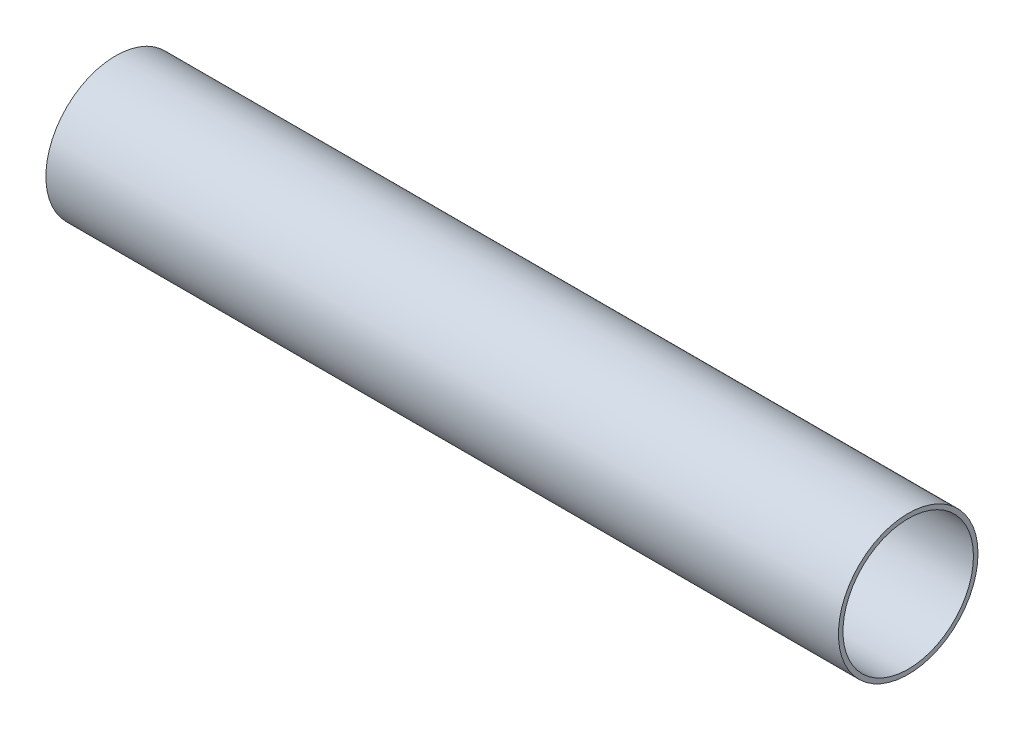
ISO-10303-21;
HEADER;
FILE_DESCRIPTION(('STEP AP214'),'2;1');
FILE_NAME('part.step','',(''),(''),'','','');
FILE_SCHEMA(('AUTOMOTIVE_DESIGN { 1 0 10303 214 1 1 1 1 }'));
ENDSEC;
DATA;
#1=APPLICATION_CONTEXT('core data for automotive mechanical design processes');
#2=APPLICATION_PROTOCOL_DEFINITION('international standard','automotive_design',2000,#1);
#3=PRODUCT_CONTEXT('',#1,'mechanical');
#4=PRODUCT('Part','Part','',(#3));
#5=PRODUCT_RELATED_PRODUCT_CATEGORY('part','',(#4));
#6=PRODUCT_DEFINITION_FORMATION('','',#4);
#7=PRODUCT_DEFINITION_CONTEXT('part definition',#1,'design');
#8=PRODUCT_DEFINITION('design','',#6,#7);
#9=PRODUCT_DEFINITION_SHAPE('','',#8);
#10=(LENGTH_UNIT() NAMED_UNIT(*) SI_UNIT(.MILLI.,.METRE.));
#11=(NAMED_UNIT(*) PLANE_ANGLE_UNIT() SI_UNIT($,.RADIAN.));
#12=(NAMED_UNIT(*) SI_UNIT($,.STERADIAN.) SOLID_ANGLE_UNIT());
#13=UNCERTAINTY_MEASURE_WITH_UNIT(LENGTH_MEASURE(1.E-05),#10,'distance_accuracy_value','');
#14=(GEOMETRIC_REPRESENTATION_CONTEXT(3) GLOBAL_UNCERTAINTY_ASSIGNED_CONTEXT((#13)) GLOBAL_UNIT_ASSIGNED_CONTEXT((#10,
#11,#12)) REPRESENTATION_CONTEXT('',''));
#15=CARTESIAN_POINT('',(0.,0.,0.));
#16=DIRECTION('',(0.,0.,1.));
#17=DIRECTION('',(1.,0.,0.));
#18=AXIS2_PLACEMENT_3D('',#15,#16,#17);
#19=CARTESIAN_POINT('',(520.7,0.,0.));
#20=DIRECTION('',(1.,0.,0.));
#21=DIRECTION('',(0.,0.,-1.));
#22=AXIS2_PLACEMENT_3D('',#19,#20,#21);
#23=PLANE('',#22);
#24=CARTESIAN_POINT('',(520.7,0.,0.));
#25=DIRECTION('',(1.,0.,0.));
#26=DIRECTION('',(0.,0.,-1.));
#27=AXIS2_PLACEMENT_3D('',#24,#25,#26);
#28=CIRCLE('',#27,45.847);
#29=CARTESIAN_POINT('',(520.7,0.,-45.847));
#30=VERTEX_POINT('',#29);
#31=EDGE_CURVE('E10',#30,#30,#28,.T.);
#32=ORIENTED_EDGE('',*,*,#31,.T.);
#33=EDGE_LOOP('',(#32));
#34=FACE_BOUND('',#33,.T.);
#35=CARTESIAN_POINT('',(520.7,0.,0.));
#36=DIRECTION('',(1.,0.,0.));
#37=DIRECTION('',(0.,0.,-1.));
#38=AXIS2_PLACEMENT_3D('',#35,#36,#37);
#39=CIRCLE('',#38,42.8625);
#40=CARTESIAN_POINT('',(520.7,0.,-42.8625));
#41=VERTEX_POINT('',#40);
#42=EDGE_CURVE('E47',#41,#41,#39,.T.);
#43=ORIENTED_EDGE('',*,*,#42,.F.);
#44=EDGE_LOOP('',(#43));
#45=FACE_BOUND('',#44,.T.);
#46=ADVANCED_FACE('F36',(#34,#45),#23,.T.);
#47=CARTESIAN_POINT('',(0.,0.,0.));
#48=DIRECTION('',(1.,0.,0.));
#49=DIRECTION('',(0.,0.,-1.));
#50=AXIS2_PLACEMENT_3D('',#47,#48,#49);
#51=PLANE('',#50);
#52=CARTESIAN_POINT('',(0.,0.,0.));
#53=DIRECTION('',(1.,0.,0.));
#54=DIRECTION('',(0.,0.,-1.));
#55=AXIS2_PLACEMENT_3D('',#52,#53,#54);
#56=CIRCLE('',#55,45.847);
#57=CARTESIAN_POINT('',(0.,0.,-45.847));
#58=VERTEX_POINT('',#57);
#59=EDGE_CURVE('E40',#58,#58,#56,.T.);
#60=ORIENTED_EDGE('',*,*,#59,.F.);
#61=EDGE_LOOP('',(#60));
#62=FACE_BOUND('',#61,.T.);
#63=CARTESIAN_POINT('',(0.,0.,0.));
#64=DIRECTION('',(1.,0.,0.));
#65=DIRECTION('',(0.,0.,-1.));
#66=AXIS2_PLACEMENT_3D('',#63,#64,#65);
#67=CIRCLE('',#66,42.8625);
#68=CARTESIAN_POINT('',(0.,0.,-42.8625));
#69=VERTEX_POINT('',#68);
#70=EDGE_CURVE('E49',#69,#69,#67,.T.);
#71=ORIENTED_EDGE('',*,*,#70,.T.);
#72=EDGE_LOOP('',(#71));
#73=FACE_BOUND('',#72,.T.);
#74=ADVANCED_FACE('F59',(#62,#73),#51,.F.);
#75=CARTESIAN_POINT('',(520.7,0.,0.));
#76=DIRECTION('',(-1.,0.,0.));
#77=DIRECTION('',(0.,0.,1.));
#78=AXIS2_PLACEMENT_3D('',#75,#76,#77);
#79=CYLINDRICAL_SURFACE('',#78,45.847);
#80=ORIENTED_EDGE('',*,*,#31,.F.);
#81=EDGE_LOOP('',(#80));
#82=FACE_BOUND('',#81,.T.);
#83=ORIENTED_EDGE('',*,*,#59,.T.);
#84=EDGE_LOOP('',(#83));
#85=FACE_BOUND('',#84,.T.);
#86=ADVANCED_FACE('F38',(#82,#85),#79,.T.);
#87=CARTESIAN_POINT('',(520.7,0.,0.));
#88=DIRECTION('',(-1.,0.,0.));
#89=DIRECTION('',(0.,0.,1.));
#90=AXIS2_PLACEMENT_3D('',#87,#88,#89);
#91=CYLINDRICAL_SURFACE('',#90,42.8625);
#92=ORIENTED_EDGE('',*,*,#42,.T.);
#93=EDGE_LOOP('',(#92));
#94=FACE_BOUND('',#93,.T.);
#95=ORIENTED_EDGE('',*,*,#70,.F.);
#96=EDGE_LOOP('',(#95));
#97=FACE_BOUND('',#96,.T.);
#98=ADVANCED_FACE('F55',(#94,#97),#91,.F.);
#99=CLOSED_SHELL('',(#46,#74,#86,#98));
#100=MANIFOLD_SOLID_BREP('B2',#99);
#101=ADVANCED_BREP_SHAPE_REPRESENTATION('',(#18,#100),#14);
#102=SHAPE_DEFINITION_REPRESENTATION(#9,#101);
ENDSEC;
END-ISO-10303-21;
